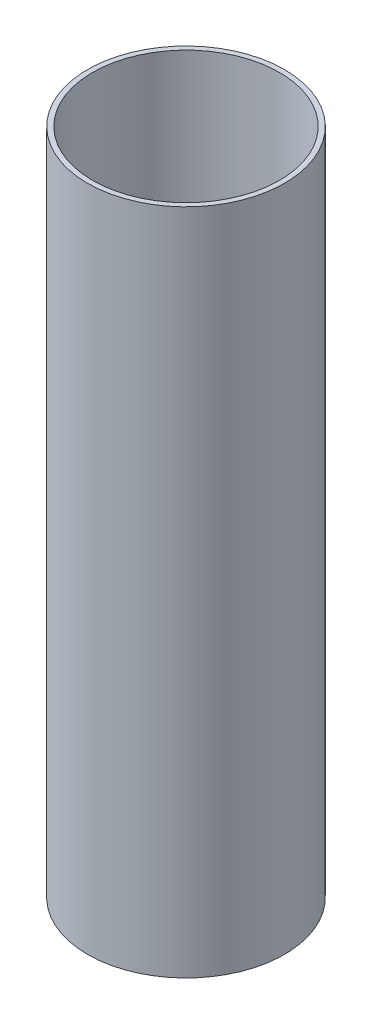
ISO-10303-21;
HEADER;
FILE_DESCRIPTION(('STEP AP214'),'2;1');
FILE_NAME('part.step','',(''),(''),'','','');
FILE_SCHEMA(('AUTOMOTIVE_DESIGN { 1 0 10303 214 1 1 1 1 }'));
ENDSEC;
DATA;
#1=APPLICATION_CONTEXT('core data for automotive mechanical design processes');
#2=APPLICATION_PROTOCOL_DEFINITION('international standard','automotive_design',2000,#1);
#3=PRODUCT_CONTEXT('',#1,'mechanical');
#4=PRODUCT('Part','Part','',(#3));
#5=PRODUCT_RELATED_PRODUCT_CATEGORY('part','',(#4));
#6=PRODUCT_DEFINITION_FORMATION('','',#4);
#7=PRODUCT_DEFINITION_CONTEXT('part definition',#1,'design');
#8=PRODUCT_DEFINITION('design','',#6,#7);
#9=PRODUCT_DEFINITION_SHAPE('','',#8);
#10=(LENGTH_UNIT() NAMED_UNIT(*) SI_UNIT(.MILLI.,.METRE.));
#11=(NAMED_UNIT(*) PLANE_ANGLE_UNIT() SI_UNIT($,.RADIAN.));
#12=(NAMED_UNIT(*) SI_UNIT($,.STERADIAN.) SOLID_ANGLE_UNIT());
#13=UNCERTAINTY_MEASURE_WITH_UNIT(LENGTH_MEASURE(1.E-05),#10,'distance_accuracy_value','');
#14=(GEOMETRIC_REPRESENTATION_CONTEXT(3) GLOBAL_UNCERTAINTY_ASSIGNED_CONTEXT((#13)) GLOBAL_UNIT_ASSIGNED_CONTEXT((#10,
#11,#12)) REPRESENTATION_CONTEXT('',''));
#15=CARTESIAN_POINT('',(0.,0.,0.));
#16=DIRECTION('',(0.,0.,1.));
#17=DIRECTION('',(1.,0.,0.));
#18=AXIS2_PLACEMENT_3D('',#15,#16,#17);
#19=CARTESIAN_POINT('',(0.,317.5,0.));
#20=DIRECTION('',(0.,1.,0.));
#21=DIRECTION('',(0.,0.,1.));
#22=AXIS2_PLACEMENT_3D('',#19,#20,#21);
#23=PLANE('',#22);
#24=CARTESIAN_POINT('',(0.,317.5,0.));
#25=DIRECTION('',(0.,1.,0.));
#26=DIRECTION('',(0.,0.,1.));
#27=AXIS2_PLACEMENT_3D('',#24,#25,#26);
#28=CIRCLE('',#27,93.6625);
#29=CARTESIAN_POINT('',(0.,317.5,93.6625));
#30=VERTEX_POINT('',#29);
#31=EDGE_CURVE('E10',#30,#30,#28,.T.);
#32=ORIENTED_EDGE('',*,*,#31,.T.);
#33=EDGE_LOOP('',(#32));
#34=FACE_BOUND('',#33,.T.);
#35=CARTESIAN_POINT('',(0.,317.5,0.));
#36=DIRECTION('',(0.,1.,0.));
#37=DIRECTION('',(0.,0.,1.));
#38=AXIS2_PLACEMENT_3D('',#35,#36,#37);
#39=CIRCLE('',#38,88.9);
#40=CARTESIAN_POINT('',(0.,317.5,88.9));
#41=VERTEX_POINT('',#40);
#42=EDGE_CURVE('E46',#41,#41,#39,.T.);
#43=ORIENTED_EDGE('',*,*,#42,.F.);
#44=EDGE_LOOP('',(#43));
#45=FACE_BOUND('',#44,.T.);
#46=ADVANCED_FACE('F35',(#34,#45),#23,.T.);
#47=CARTESIAN_POINT('',(0.,-317.5,0.));
#48=DIRECTION('',(0.,1.,0.));
#49=DIRECTION('',(0.,0.,1.));
#50=AXIS2_PLACEMENT_3D('',#47,#48,#49);
#51=PLANE('',#50);
#52=CARTESIAN_POINT('',(0.,-317.5,0.));
#53=DIRECTION('',(0.,1.,0.));
#54=DIRECTION('',(0.,0.,1.));
#55=AXIS2_PLACEMENT_3D('',#52,#53,#54);
#56=CIRCLE('',#55,93.6625);
#57=CARTESIAN_POINT('',(0.,-317.5,93.6625));
#58=VERTEX_POINT('',#57);
#59=EDGE_CURVE('E39',#58,#58,#56,.T.);
#60=ORIENTED_EDGE('',*,*,#59,.F.);
#61=EDGE_LOOP('',(#60));
#62=FACE_BOUND('',#61,.T.);
#63=CARTESIAN_POINT('',(0.,-317.5,0.));
#64=DIRECTION('',(0.,1.,0.));
#65=DIRECTION('',(0.,0.,1.));
#66=AXIS2_PLACEMENT_3D('',#63,#64,#65);
#67=CIRCLE('',#66,88.9);
#68=CARTESIAN_POINT('',(0.,-317.5,88.9));
#69=VERTEX_POINT('',#68);
#70=EDGE_CURVE('E48',#69,#69,#67,.T.);
#71=ORIENTED_EDGE('',*,*,#70,.T.);
#72=EDGE_LOOP('',(#71));
#73=FACE_BOUND('',#72,.T.);
#74=ADVANCED_FACE('F58',(#62,#73),#51,.F.);
#75=CARTESIAN_POINT('',(0.,317.5,0.));
#76=DIRECTION('',(0.,-1.,0.));
#77=DIRECTION('',(0.,0.,-1.));
#78=AXIS2_PLACEMENT_3D('',#75,#76,#77);
#79=CYLINDRICAL_SURFACE('',#78,93.6625);
#80=ORIENTED_EDGE('',*,*,#31,.F.);
#81=EDGE_LOOP('',(#80));
#82=FACE_BOUND('',#81,.T.);
#83=ORIENTED_EDGE('',*,*,#59,.T.);
#84=EDGE_LOOP('',(#83));
#85=FACE_BOUND('',#84,.T.);
#86=ADVANCED_FACE('F37',(#82,#85),#79,.T.);
#87=CARTESIAN_POINT('',(0.,317.5,0.));
#88=DIRECTION('',(0.,-1.,0.));
#89=DIRECTION('',(0.,0.,-1.));
#90=AXIS2_PLACEMENT_3D('',#87,#88,#89);
#91=CYLINDRICAL_SURFACE('',#90,88.9);
#92=ORIENTED_EDGE('',*,*,#42,.T.);
#93=EDGE_LOOP('',(#92));
#94=FACE_BOUND('',#93,.T.);
#95=ORIENTED_EDGE('',*,*,#70,.F.);
#96=EDGE_LOOP('',(#95));
#97=FACE_BOUND('',#96,.T.);
#98=ADVANCED_FACE('F54',(#94,#97),#91,.F.);
#99=CLOSED_SHELL('',(#46,#74,#86,#98));
#100=MANIFOLD_SOLID_BREP('B2',#99);
#101=ADVANCED_BREP_SHAPE_REPRESENTATION('',(#18,#100),#14);
#102=SHAPE_DEFINITION_REPRESENTATION(#9,#101);
ENDSEC;
END-ISO-10303-21;
